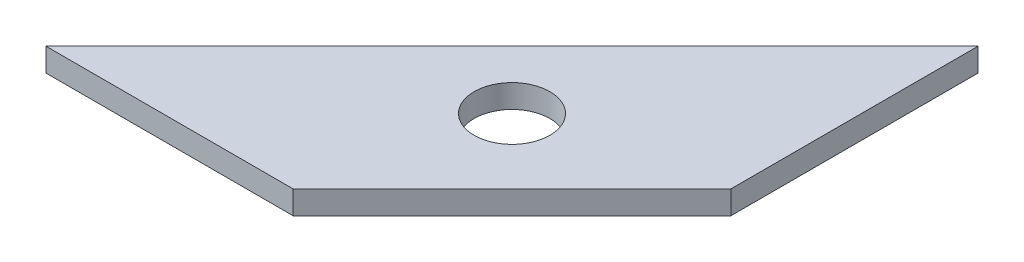
ISO-10303-21;
HEADER;
FILE_DESCRIPTION(('STEP AP214'),'2;1');
FILE_NAME('part.step','',(''),(''),'','','');
FILE_SCHEMA(('AUTOMOTIVE_DESIGN { 1 0 10303 214 1 1 1 1 }'));
ENDSEC;
DATA;
#1=APPLICATION_CONTEXT('core data for automotive mechanical design processes');
#2=APPLICATION_PROTOCOL_DEFINITION('international standard','automotive_design',2000,#1);
#3=PRODUCT_CONTEXT('',#1,'mechanical');
#4=PRODUCT('Part','Part','',(#3));
#5=PRODUCT_RELATED_PRODUCT_CATEGORY('part','',(#4));
#6=PRODUCT_DEFINITION_FORMATION('','',#4);
#7=PRODUCT_DEFINITION_CONTEXT('part definition',#1,'design');
#8=PRODUCT_DEFINITION('design','',#6,#7);
#9=PRODUCT_DEFINITION_SHAPE('','',#8);
#10=(LENGTH_UNIT() NAMED_UNIT(*) SI_UNIT(.MILLI.,.METRE.));
#11=(NAMED_UNIT(*) PLANE_ANGLE_UNIT() SI_UNIT($,.RADIAN.));
#12=(NAMED_UNIT(*) SI_UNIT($,.STERADIAN.) SOLID_ANGLE_UNIT());
#13=UNCERTAINTY_MEASURE_WITH_UNIT(LENGTH_MEASURE(1.E-05),#10,'distance_accuracy_value','');
#14=(GEOMETRIC_REPRESENTATION_CONTEXT(3) GLOBAL_UNCERTAINTY_ASSIGNED_CONTEXT((#13)) GLOBAL_UNIT_ASSIGNED_CONTEXT((#10,
#11,#12)) REPRESENTATION_CONTEXT('',''));
#15=CARTESIAN_POINT('',(0.,0.,0.));
#16=DIRECTION('',(0.,0.,1.));
#17=DIRECTION('',(1.,0.,0.));
#18=AXIS2_PLACEMENT_3D('',#15,#16,#17);
#19=CARTESIAN_POINT('',(0.,2.,-40.));
#20=DIRECTION('',(0.707106781186547,0.,0.707106781186547));
#21=DIRECTION('',(0.707106781186548,0.,-0.707106781186548));
#22=AXIS2_PLACEMENT_3D('',#19,#20,#21);
#23=PLANE('',#22);
#24=DIRECTION('',(-0.707106781186548,0.,0.707106781186548));
#25=VECTOR('',#24,1.);
#26=CARTESIAN_POINT('',(0.,0.,-40.));
#27=LINE('',#26,#25);
#28=CARTESIAN_POINT('',(0.,0.,-40.));
#29=VERTEX_POINT('',#28);
#30=CARTESIAN_POINT('',(-40.,0.,0.));
#31=VERTEX_POINT('',#30);
#32=EDGE_CURVE('E99',#29,#31,#27,.T.);
#33=ORIENTED_EDGE('',*,*,#32,.T.);
#34=DIRECTION('',(0.,-1.,0.));
#35=VECTOR('',#34,1.);
#36=CARTESIAN_POINT('',(-40.,2.,0.));
#37=LINE('',#36,#35);
#38=CARTESIAN_POINT('',(-40.,2.,0.));
#39=VERTEX_POINT('',#38);
#40=EDGE_CURVE('E11',#39,#31,#37,.T.);
#41=ORIENTED_EDGE('',*,*,#40,.F.);
#42=DIRECTION('',(-0.707106781186548,0.,0.707106781186548));
#43=VECTOR('',#42,1.);
#44=CARTESIAN_POINT('',(0.,2.,-40.));
#45=LINE('',#44,#43);
#46=CARTESIAN_POINT('',(0.,2.,-40.));
#47=VERTEX_POINT('',#46);
#48=EDGE_CURVE('E87',#47,#39,#45,.T.);
#49=ORIENTED_EDGE('',*,*,#48,.F.);
#50=DIRECTION('',(0.,-1.,0.));
#51=VECTOR('',#50,1.);
#52=CARTESIAN_POINT('',(0.,2.,-40.));
#53=LINE('',#52,#51);
#54=EDGE_CURVE('E95',#47,#29,#53,.T.);
#55=ORIENTED_EDGE('',*,*,#54,.T.);
#56=EDGE_LOOP('',(#33,#41,#49,#55));
#57=FACE_BOUND('',#56,.T.);
#58=ADVANCED_FACE('F36',(#57),#23,.F.);
#59=CARTESIAN_POINT('',(-40.,2.,0.));
#60=DIRECTION('',(0.,0.,-1.));
#61=DIRECTION('',(-1.,0.,0.));
#62=AXIS2_PLACEMENT_3D('',#59,#60,#61);
#63=PLANE('',#62);
#64=DIRECTION('',(1.,0.,0.));
#65=VECTOR('',#64,1.);
#66=CARTESIAN_POINT('',(-40.,0.,0.));
#67=LINE('',#66,#65);
#68=CARTESIAN_POINT('',(-18.7867965644036,0.,0.));
#69=VERTEX_POINT('',#68);
#70=EDGE_CURVE('E91',#31,#69,#67,.T.);
#71=ORIENTED_EDGE('',*,*,#70,.T.);
#72=DIRECTION('',(0.,-1.,0.));
#73=VECTOR('',#72,1.);
#74=CARTESIAN_POINT('',(-18.7867965644036,2.,0.));
#75=LINE('',#74,#73);
#76=CARTESIAN_POINT('',(-18.7867965644036,2.,0.));
#77=VERTEX_POINT('',#76);
#78=EDGE_CURVE('E44',#77,#69,#75,.T.);
#79=ORIENTED_EDGE('',*,*,#78,.F.);
#80=DIRECTION('',(1.,0.,0.));
#81=VECTOR('',#80,1.);
#82=CARTESIAN_POINT('',(-40.,2.,0.));
#83=LINE('',#82,#81);
#84=EDGE_CURVE('E82',#39,#77,#83,.T.);
#85=ORIENTED_EDGE('',*,*,#84,.F.);
#86=ORIENTED_EDGE('',*,*,#40,.T.);
#87=EDGE_LOOP('',(#71,#79,#85,#86));
#88=FACE_BOUND('',#87,.T.);
#89=ADVANCED_FACE('F90',(#88),#63,.F.);
#90=CARTESIAN_POINT('',(-18.7867965644036,2.,0.));
#91=DIRECTION('',(-0.707106781186547,0.,-0.707106781186547));
#92=DIRECTION('',(-0.707106781186548,0.,0.707106781186548));
#93=AXIS2_PLACEMENT_3D('',#90,#91,#92);
#94=PLANE('',#93);
#95=DIRECTION('',(0.707106781186548,0.,-0.707106781186548));
#96=VECTOR('',#95,1.);
#97=CARTESIAN_POINT('',(-18.7867965644036,0.,0.));
#98=LINE('',#97,#96);
#99=CARTESIAN_POINT('',(0.,0.,-18.7867965644036));
#100=VERTEX_POINT('',#99);
#101=EDGE_CURVE('E69',#69,#100,#98,.T.);
#102=ORIENTED_EDGE('',*,*,#101,.T.);
#103=DIRECTION('',(0.,-1.,0.));
#104=VECTOR('',#103,1.);
#105=CARTESIAN_POINT('',(0.,2.,-18.7867965644036));
#106=LINE('',#105,#104);
#107=CARTESIAN_POINT('',(0.,2.,-18.7867965644036));
#108=VERTEX_POINT('',#107);
#109=EDGE_CURVE('E92',#108,#100,#106,.T.);
#110=ORIENTED_EDGE('',*,*,#109,.F.);
#111=DIRECTION('',(0.707106781186548,0.,-0.707106781186548));
#112=VECTOR('',#111,1.);
#113=CARTESIAN_POINT('',(-18.7867965644036,2.,0.));
#114=LINE('',#113,#112);
#115=EDGE_CURVE('E85',#77,#108,#114,.T.);
#116=ORIENTED_EDGE('',*,*,#115,.F.);
#117=ORIENTED_EDGE('',*,*,#78,.T.);
#118=EDGE_LOOP('',(#102,#110,#116,#117));
#119=FACE_BOUND('',#118,.T.);
#120=ADVANCED_FACE('F93',(#119),#94,.F.);
#121=CARTESIAN_POINT('',(0.,2.,-18.7867965644036));
#122=DIRECTION('',(-1.,0.,0.));
#123=DIRECTION('',(0.,0.,1.));
#124=AXIS2_PLACEMENT_3D('',#121,#122,#123);
#125=PLANE('',#124);
#126=DIRECTION('',(0.,0.,-1.));
#127=VECTOR('',#126,1.);
#128=CARTESIAN_POINT('',(0.,0.,-18.7867965644036));
#129=LINE('',#128,#127);
#130=EDGE_CURVE('E75',#100,#29,#129,.T.);
#131=ORIENTED_EDGE('',*,*,#130,.T.);
#132=ORIENTED_EDGE('',*,*,#54,.F.);
#133=DIRECTION('',(0.,0.,-1.));
#134=VECTOR('',#133,1.);
#135=CARTESIAN_POINT('',(0.,2.,-18.7867965644036));
#136=LINE('',#135,#134);
#137=EDGE_CURVE('E52',#108,#47,#136,.T.);
#138=ORIENTED_EDGE('',*,*,#137,.F.);
#139=ORIENTED_EDGE('',*,*,#109,.T.);
#140=EDGE_LOOP('',(#131,#132,#138,#139));
#141=FACE_BOUND('',#140,.T.);
#142=ADVANCED_FACE('F107',(#141),#125,.F.);
#143=CARTESIAN_POINT('',(0.,2.,0.));
#144=DIRECTION('',(0.,1.,0.));
#145=DIRECTION('',(0.,0.,1.));
#146=AXIS2_PLACEMENT_3D('',#143,#144,#145);
#147=PLANE('',#146);
#148=CARTESIAN_POINT('',(-15.,2.,-15.));
#149=DIRECTION('',(0.,1.,0.));
#150=DIRECTION('',(0.,0.,1.));
#151=AXIS2_PLACEMENT_3D('',#148,#149,#150);
#152=CIRCLE('',#151,3.25);
#153=CARTESIAN_POINT('',(-15.,2.,-11.75));
#154=VERTEX_POINT('',#153);
#155=EDGE_CURVE('E115',#154,#154,#152,.T.);
#156=ORIENTED_EDGE('',*,*,#155,.F.);
#157=EDGE_LOOP('',(#156));
#158=FACE_BOUND('',#157,.T.);
#159=ORIENTED_EDGE('',*,*,#48,.T.);
#160=ORIENTED_EDGE('',*,*,#84,.T.);
#161=ORIENTED_EDGE('',*,*,#115,.T.);
#162=ORIENTED_EDGE('',*,*,#137,.T.);
#163=EDGE_LOOP('',(#159,#160,#161,#162));
#164=FACE_BOUND('',#163,.T.);
#165=ADVANCED_FACE('F83',(#158,#164),#147,.T.);
#166=CARTESIAN_POINT('',(0.,0.,0.));
#167=DIRECTION('',(0.,1.,0.));
#168=DIRECTION('',(0.,0.,1.));
#169=AXIS2_PLACEMENT_3D('',#166,#167,#168);
#170=PLANE('',#169);
#171=CARTESIAN_POINT('',(-15.,0.,-15.));
#172=DIRECTION('',(0.,1.,0.));
#173=DIRECTION('',(0.,0.,1.));
#174=AXIS2_PLACEMENT_3D('',#171,#172,#173);
#175=CIRCLE('',#174,3.25);
#176=CARTESIAN_POINT('',(-15.,0.,-11.75));
#177=VERTEX_POINT('',#176);
#178=EDGE_CURVE('E102',#177,#177,#175,.T.);
#179=ORIENTED_EDGE('',*,*,#178,.T.);
#180=EDGE_LOOP('',(#179));
#181=FACE_BOUND('',#180,.T.);
#182=ORIENTED_EDGE('',*,*,#32,.F.);
#183=ORIENTED_EDGE('',*,*,#130,.F.);
#184=ORIENTED_EDGE('',*,*,#101,.F.);
#185=ORIENTED_EDGE('',*,*,#70,.F.);
#186=EDGE_LOOP('',(#182,#183,#184,#185));
#187=FACE_BOUND('',#186,.T.);
#188=ADVANCED_FACE('F110',(#181,#187),#170,.F.);
#189=CARTESIAN_POINT('',(-15.,2.,-15.));
#190=DIRECTION('',(0.,1.,0.));
#191=DIRECTION('',(0.,0.,1.));
#192=AXIS2_PLACEMENT_3D('',#189,#190,#191);
#193=CYLINDRICAL_SURFACE('',#192,3.25);
#194=ORIENTED_EDGE('',*,*,#178,.F.);
#195=EDGE_LOOP('',(#194));
#196=FACE_BOUND('',#195,.T.);
#197=ORIENTED_EDGE('',*,*,#155,.T.);
#198=EDGE_LOOP('',(#197));
#199=FACE_BOUND('',#198,.T.);
#200=ADVANCED_FACE('F119',(#196,#199),#193,.F.);
#201=CLOSED_SHELL('',(#58,#89,#120,#142,#165,#188,#200));
#202=MANIFOLD_SOLID_BREP('B2',#201);
#203=ADVANCED_BREP_SHAPE_REPRESENTATION('',(#18,#202),#14);
#204=SHAPE_DEFINITION_REPRESENTATION(#9,#203);
ENDSEC;
END-ISO-10303-21;
